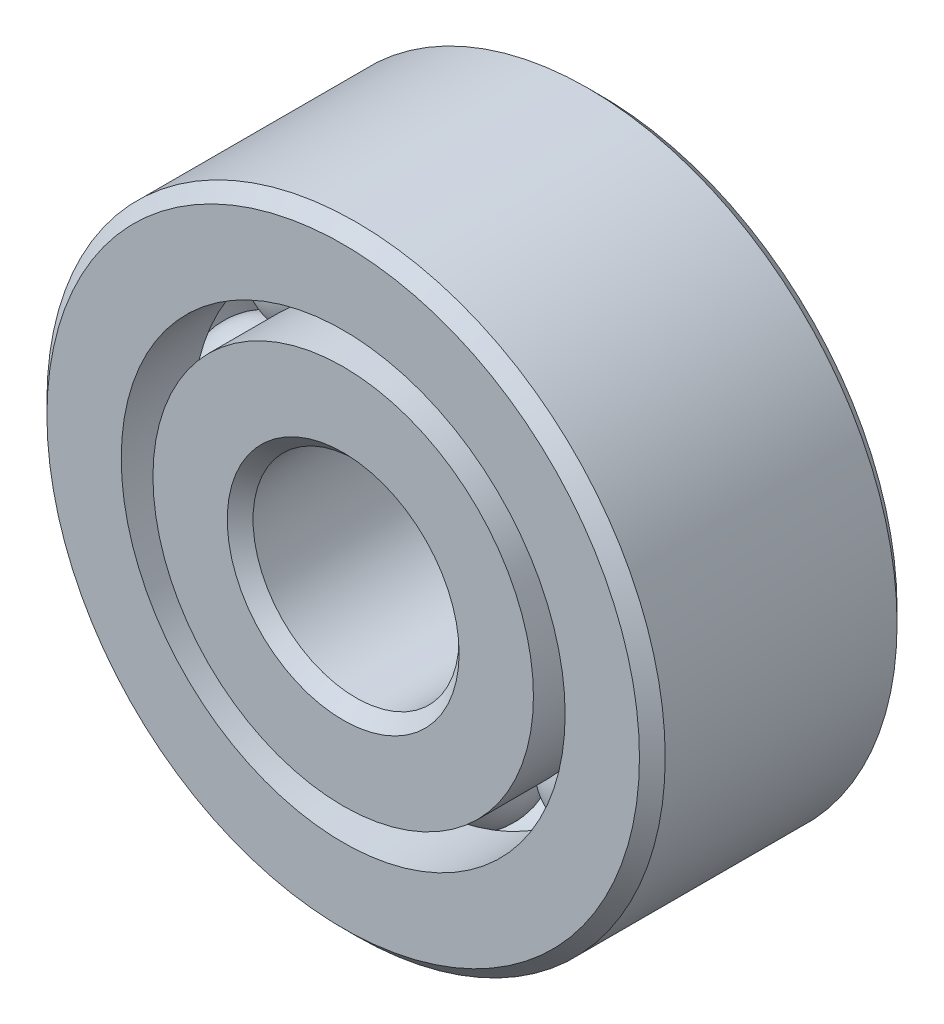
ISO-10303-21;
HEADER;
FILE_DESCRIPTION(('STEP AP214'),'2;1');
FILE_NAME('part.step','',(''),(''),'','','');
FILE_SCHEMA(('AUTOMOTIVE_DESIGN { 1 0 10303 214 1 1 1 1 }'));
ENDSEC;
DATA;
#1=APPLICATION_CONTEXT('core data for automotive mechanical design processes');
#2=APPLICATION_PROTOCOL_DEFINITION('international standard','automotive_design',2000,#1);
#3=PRODUCT_CONTEXT('',#1,'mechanical');
#4=PRODUCT('Part','Part','',(#3));
#5=PRODUCT_RELATED_PRODUCT_CATEGORY('part','',(#4));
#6=PRODUCT_DEFINITION_FORMATION('','',#4);
#7=PRODUCT_DEFINITION_CONTEXT('part definition',#1,'design');
#8=PRODUCT_DEFINITION('design','',#6,#7);
#9=PRODUCT_DEFINITION_SHAPE('','',#8);
#10=(LENGTH_UNIT() NAMED_UNIT(*) SI_UNIT(.MILLI.,.METRE.));
#11=(NAMED_UNIT(*) PLANE_ANGLE_UNIT() SI_UNIT($,.RADIAN.));
#12=(NAMED_UNIT(*) SI_UNIT($,.STERADIAN.) SOLID_ANGLE_UNIT());
#13=UNCERTAINTY_MEASURE_WITH_UNIT(LENGTH_MEASURE(1.E-05),#10,'distance_accuracy_value','');
#14=(GEOMETRIC_REPRESENTATION_CONTEXT(3) GLOBAL_UNCERTAINTY_ASSIGNED_CONTEXT((#13)) GLOBAL_UNIT_ASSIGNED_CONTEXT((#10,
#11,#12)) REPRESENTATION_CONTEXT('',''));
#15=CARTESIAN_POINT('',(0.,0.,0.));
#16=DIRECTION('',(0.,0.,1.));
#17=DIRECTION('',(1.,0.,0.));
#18=AXIS2_PLACEMENT_3D('',#15,#16,#17);
#19=CARTESIAN_POINT('',(-2.24506403026726,2.24506403026731,0.));
#20=DIRECTION('',(0.,0.,1.));
#21=DIRECTION('',(-0.707106781186539,0.707106781186556,0.));
#22=AXIS2_PLACEMENT_3D('',#19,#20,#21);
#23=SPHERICAL_SURFACE('',#22,0.915136422466877);
#24=CARTESIAN_POINT('',(-2.24506403026726,2.24506403026731,0.915136422466874));
#25=VERTEX_POINT('',#24);
#26=VERTEX_LOOP('',#25);
#27=FACE_BOUND('',#26,.T.);
#28=ADVANCED_FACE('F39',(#27),#23,.T.);
#29=CLOSED_SHELL('',(#28));
#30=MANIFOLD_SOLID_BREP('B2',#29);
#31=CARTESIAN_POINT('',(-3.175,0.,0.));
#32=DIRECTION('',(0.,0.,1.));
#33=DIRECTION('',(-1.,0.,0.));
#34=AXIS2_PLACEMENT_3D('',#31,#32,#33);
#35=SPHERICAL_SURFACE('',#34,0.915136422466877);
#36=CARTESIAN_POINT('',(-3.175,0.,0.915136422466874));
#37=VERTEX_POINT('',#36);
#38=VERTEX_LOOP('',#37);
#39=FACE_BOUND('',#38,.T.);
#40=ADVANCED_FACE('F59',(#39),#35,.T.);
#41=CLOSED_SHELL('',(#40));
#42=MANIFOLD_SOLID_BREP('B6',#41);
#43=CARTESIAN_POINT('',(-2.24506403026731,-2.24506403026727,0.));
#44=DIRECTION('',(0.,0.,1.));
#45=DIRECTION('',(-0.707106781186554,-0.707106781186541,0.));
#46=AXIS2_PLACEMENT_3D('',#43,#44,#45);
#47=SPHERICAL_SURFACE('',#46,0.915136422466877);
#48=CARTESIAN_POINT('',(-2.24506403026731,-2.24506403026727,0.915136422466874));
#49=VERTEX_POINT('',#48);
#50=VERTEX_LOOP('',#49);
#51=FACE_BOUND('',#50,.T.);
#52=ADVANCED_FACE('F79',(#51),#47,.T.);
#53=CLOSED_SHELL('',(#52));
#54=MANIFOLD_SOLID_BREP('B35',#53);
#55=CARTESIAN_POINT('',(0.,-3.175,0.));
#56=DIRECTION('',(0.,0.,1.));
#57=DIRECTION('',(0.,-1.,0.));
#58=AXIS2_PLACEMENT_3D('',#55,#56,#57);
#59=SPHERICAL_SURFACE('',#58,0.915136422466877);
#60=CARTESIAN_POINT('',(0.,-3.175,0.915136422466874));
#61=VERTEX_POINT('',#60);
#62=VERTEX_LOOP('',#61);
#63=FACE_BOUND('',#62,.T.);
#64=ADVANCED_FACE('F99',(#63),#59,.T.);
#65=CLOSED_SHELL('',(#64));
#66=MANIFOLD_SOLID_BREP('B55',#65);
#67=CARTESIAN_POINT('',(2.24506403026727,-2.2450640302673,0.));
#68=DIRECTION('',(0.,0.,1.));
#69=DIRECTION('',(0.707106781186544,-0.707106781186551,0.));
#70=AXIS2_PLACEMENT_3D('',#67,#68,#69);
#71=SPHERICAL_SURFACE('',#70,0.915136422466877);
#72=CARTESIAN_POINT('',(2.24506403026727,-2.2450640302673,0.915136422466874));
#73=VERTEX_POINT('',#72);
#74=VERTEX_LOOP('',#73);
#75=FACE_BOUND('',#74,.T.);
#76=ADVANCED_FACE('F119',(#75),#71,.T.);
#77=CLOSED_SHELL('',(#76));
#78=MANIFOLD_SOLID_BREP('B75',#77);
#79=CARTESIAN_POINT('',(3.175,0.,0.));
#80=DIRECTION('',(0.,0.,1.));
#81=DIRECTION('',(1.,0.,0.));
#82=AXIS2_PLACEMENT_3D('',#79,#80,#81);
#83=SPHERICAL_SURFACE('',#82,0.915136422466877);
#84=CARTESIAN_POINT('',(3.175,0.,0.915136422466874));
#85=VERTEX_POINT('',#84);
#86=VERTEX_LOOP('',#85);
#87=FACE_BOUND('',#86,.T.);
#88=ADVANCED_FACE('F139',(#87),#83,.T.);
#89=CLOSED_SHELL('',(#88));
#90=MANIFOLD_SOLID_BREP('B95',#89);
#91=CARTESIAN_POINT('',(2.24506403026729,2.24506403026728,0.));
#92=DIRECTION('',(0.,0.,1.));
#93=DIRECTION('',(0.707106781186549,0.707106781186546,0.));
#94=AXIS2_PLACEMENT_3D('',#91,#92,#93);
#95=SPHERICAL_SURFACE('',#94,0.915136422466877);
#96=CARTESIAN_POINT('',(2.24506403026729,2.24506403026728,0.915136422466874));
#97=VERTEX_POINT('',#96);
#98=VERTEX_LOOP('',#97);
#99=FACE_BOUND('',#98,.T.);
#100=ADVANCED_FACE('F159',(#99),#95,.T.);
#101=CLOSED_SHELL('',(#100));
#102=MANIFOLD_SOLID_BREP('B115',#101);
#103=CARTESIAN_POINT('',(0.,3.175,0.));
#104=DIRECTION('',(0.,0.,1.));
#105=DIRECTION('',(0.,1.,0.));
#106=AXIS2_PLACEMENT_3D('',#103,#104,#105);
#107=SPHERICAL_SURFACE('',#106,0.915136422466877);
#108=CARTESIAN_POINT('',(0.,3.175,0.915136422466874));
#109=VERTEX_POINT('',#108);
#110=VERTEX_LOOP('',#109);
#111=FACE_BOUND('',#110,.T.);
#112=ADVANCED_FACE('F181',(#111),#107,.T.);
#113=CLOSED_SHELL('',(#112));
#114=MANIFOLD_SOLID_BREP('B135',#113);
#115=CARTESIAN_POINT('',(0.,2.93076923076923,1.984375));
#116=DIRECTION('',(0.,0.,-1.));
#117=DIRECTION('',(-1.,0.,0.));
#118=AXIS2_PLACEMENT_3D('',#115,#116,#117);
#119=PLANE('',#118);
#120=CARTESIAN_POINT('',(0.,0.,1.984375));
#121=DIRECTION('',(0.,0.,1.));
#122=DIRECTION('',(1.,0.,0.));
#123=AXIS2_PLACEMENT_3D('',#120,#121,#122);
#124=CIRCLE('',#123,1.7859375);
#125=CARTESIAN_POINT('',(1.7859375,0.,1.984375));
#126=VERTEX_POINT('',#125);
#127=EDGE_CURVE('E228',#126,#126,#124,.T.);
#128=ORIENTED_EDGE('',*,*,#127,.F.);
#129=EDGE_LOOP('',(#128));
#130=FACE_BOUND('',#129,.T.);
#131=CARTESIAN_POINT('',(0.,0.,1.984375));
#132=DIRECTION('',(0.,0.,1.));
#133=DIRECTION('',(1.,0.,0.));
#134=AXIS2_PLACEMENT_3D('',#131,#132,#133);
#135=CIRCLE('',#134,2.93076923076923);
#136=CARTESIAN_POINT('',(2.93076923076923,0.,1.984375));
#137=VERTEX_POINT('',#136);
#138=EDGE_CURVE('E180',#137,#137,#135,.T.);
#139=ORIENTED_EDGE('',*,*,#138,.T.);
#140=EDGE_LOOP('',(#139));
#141=FACE_BOUND('',#140,.T.);
#142=ADVANCED_FACE('F200',(#130,#141),#119,.F.);
#143=CARTESIAN_POINT('',(0.,0.,1.984375));
#144=DIRECTION('',(0.,0.,1.));
#145=DIRECTION('',(1.,0.,0.));
#146=AXIS2_PLACEMENT_3D('',#143,#144,#145);
#147=CYLINDRICAL_SURFACE('',#146,2.93076923076923);
#148=ORIENTED_EDGE('',*,*,#138,.F.);
#149=EDGE_LOOP('',(#148));
#150=FACE_BOUND('',#149,.T.);
#151=CARTESIAN_POINT('',(0.,0.,0.881944444444442));
#152=DIRECTION('',(0.,0.,1.));
#153=DIRECTION('',(1.,0.,0.));
#154=AXIS2_PLACEMENT_3D('',#151,#152,#153);
#155=CIRCLE('',#154,2.93076923076923);
#156=CARTESIAN_POINT('',(2.93076923076923,0.,0.881944444444442));
#157=VERTEX_POINT('',#156);
#158=EDGE_CURVE('E206',#157,#157,#155,.T.);
#159=ORIENTED_EDGE('',*,*,#158,.T.);
#160=EDGE_LOOP('',(#159));
#161=FACE_BOUND('',#160,.T.);
#162=ADVANCED_FACE('F235',(#150,#161),#147,.T.);
#163=CARTESIAN_POINT('',(0.,0.,0.));
#164=DIRECTION('',(0.,0.,1.));
#165=DIRECTION('',(1.,0.,0.));
#166=AXIS2_PLACEMENT_3D('',#163,#164,#165);
#167=TOROIDAL_SURFACE('',#166,3.175,0.915136422466873);
#168=ORIENTED_EDGE('',*,*,#158,.F.);
#169=EDGE_LOOP('',(#168));
#170=FACE_BOUND('',#169,.T.);
#171=CARTESIAN_POINT('',(0.,0.,-0.881944444444445));
#172=DIRECTION('',(0.,0.,1.));
#173=DIRECTION('',(1.,0.,0.));
#174=AXIS2_PLACEMENT_3D('',#171,#172,#173);
#175=CIRCLE('',#174,2.93076923076923);
#176=CARTESIAN_POINT('',(2.93076923076923,0.,-0.881944444444445));
#177=VERTEX_POINT('',#176);
#178=EDGE_CURVE('E210',#177,#177,#175,.T.);
#179=ORIENTED_EDGE('',*,*,#178,.T.);
#180=EDGE_LOOP('',(#179));
#181=FACE_BOUND('',#180,.T.);
#182=ADVANCED_FACE('F239',(#170,#181),#167,.F.);
#183=CARTESIAN_POINT('',(0.,0.,1.984375));
#184=DIRECTION('',(0.,0.,1.));
#185=DIRECTION('',(1.,0.,0.));
#186=AXIS2_PLACEMENT_3D('',#183,#184,#185);
#187=CYLINDRICAL_SURFACE('',#186,2.93076923076923);
#188=ORIENTED_EDGE('',*,*,#178,.F.);
#189=EDGE_LOOP('',(#188));
#190=FACE_BOUND('',#189,.T.);
#191=CARTESIAN_POINT('',(0.,0.,-1.984375));
#192=DIRECTION('',(0.,0.,1.));
#193=DIRECTION('',(1.,0.,0.));
#194=AXIS2_PLACEMENT_3D('',#191,#192,#193);
#195=CIRCLE('',#194,2.93076923076923);
#196=CARTESIAN_POINT('',(2.93076923076923,0.,-1.984375));
#197=VERTEX_POINT('',#196);
#198=EDGE_CURVE('E214',#197,#197,#195,.T.);
#199=ORIENTED_EDGE('',*,*,#198,.T.);
#200=EDGE_LOOP('',(#199));
#201=FACE_BOUND('',#200,.T.);
#202=ADVANCED_FACE('F244',(#190,#201),#187,.T.);
#203=CARTESIAN_POINT('',(0.,1.7859375,-1.984375));
#204=DIRECTION('',(0.,0.,1.));
#205=DIRECTION('',(1.,0.,0.));
#206=AXIS2_PLACEMENT_3D('',#203,#204,#205);
#207=PLANE('',#206);
#208=ORIENTED_EDGE('',*,*,#198,.F.);
#209=EDGE_LOOP('',(#208));
#210=FACE_BOUND('',#209,.T.);
#211=CARTESIAN_POINT('',(0.,0.,-1.98437500000001));
#212=DIRECTION('',(0.,0.,1.));
#213=DIRECTION('',(1.,0.,0.));
#214=AXIS2_PLACEMENT_3D('',#211,#212,#213);
#215=CIRCLE('',#214,1.7859375);
#216=CARTESIAN_POINT('',(1.7859375,0.,-1.98437500000001));
#217=VERTEX_POINT('',#216);
#218=EDGE_CURVE('E219',#217,#217,#215,.T.);
#219=ORIENTED_EDGE('',*,*,#218,.T.);
#220=EDGE_LOOP('',(#219));
#221=FACE_BOUND('',#220,.T.);
#222=ADVANCED_FACE('F250',(#210,#221),#207,.F.);
#223=CARTESIAN_POINT('',(0.,0.,-1.78593750000001));
#224=DIRECTION('',(0.,0.,-1.));
#225=DIRECTION('',(-1.,0.,0.));
#226=AXIS2_PLACEMENT_3D('',#223,#224,#225);
#227=CONICAL_SURFACE('',#226,1.5875,0.785398163397446);
#228=ORIENTED_EDGE('',*,*,#218,.F.);
#229=EDGE_LOOP('',(#228));
#230=FACE_BOUND('',#229,.T.);
#231=CARTESIAN_POINT('',(0.,0.,-1.78593750000001));
#232=DIRECTION('',(0.,0.,1.));
#233=DIRECTION('',(1.,0.,0.));
#234=AXIS2_PLACEMENT_3D('',#231,#232,#233);
#235=CIRCLE('',#234,1.5875);
#236=CARTESIAN_POINT('',(1.5875,0.,-1.78593750000001));
#237=VERTEX_POINT('',#236);
#238=EDGE_CURVE('E222',#237,#237,#235,.T.);
#239=ORIENTED_EDGE('',*,*,#238,.T.);
#240=EDGE_LOOP('',(#239));
#241=FACE_BOUND('',#240,.T.);
#242=ADVANCED_FACE('F254',(#230,#241),#227,.F.);
#243=CARTESIAN_POINT('',(0.,0.,1.984375));
#244=DIRECTION('',(0.,0.,1.));
#245=DIRECTION('',(1.,0.,0.));
#246=AXIS2_PLACEMENT_3D('',#243,#244,#245);
#247=CYLINDRICAL_SURFACE('',#246,1.5875);
#248=ORIENTED_EDGE('',*,*,#238,.F.);
#249=EDGE_LOOP('',(#248));
#250=FACE_BOUND('',#249,.T.);
#251=CARTESIAN_POINT('',(0.,0.,1.7859375));
#252=DIRECTION('',(0.,0.,1.));
#253=DIRECTION('',(1.,0.,0.));
#254=AXIS2_PLACEMENT_3D('',#251,#252,#253);
#255=CIRCLE('',#254,1.5875);
#256=CARTESIAN_POINT('',(1.5875,0.,1.7859375));
#257=VERTEX_POINT('',#256);
#258=EDGE_CURVE('E225',#257,#257,#255,.T.);
#259=ORIENTED_EDGE('',*,*,#258,.T.);
#260=EDGE_LOOP('',(#259));
#261=FACE_BOUND('',#260,.T.);
#262=ADVANCED_FACE('F258',(#250,#261),#247,.F.);
#263=CARTESIAN_POINT('',(0.,0.,1.984375));
#264=DIRECTION('',(0.,0.,1.));
#265=DIRECTION('',(1.,0.,0.));
#266=AXIS2_PLACEMENT_3D('',#263,#264,#265);
#267=CONICAL_SURFACE('',#266,1.7859375,0.785398163397446);
#268=ORIENTED_EDGE('',*,*,#258,.F.);
#269=EDGE_LOOP('',(#268));
#270=FACE_BOUND('',#269,.T.);
#271=ORIENTED_EDGE('',*,*,#127,.T.);
#272=EDGE_LOOP('',(#271));
#273=FACE_BOUND('',#272,.T.);
#274=ADVANCED_FACE('F232',(#270,#273),#267,.F.);
#275=CLOSED_SHELL('',(#142,#162,#182,#202,#222,#242,#262,#274));
#276=MANIFOLD_SOLID_BREP('B155',#275);
#277=CARTESIAN_POINT('',(0.,0.,1.7859375));
#278=DIRECTION('',(0.,0.,-1.));
#279=DIRECTION('',(-1.,0.,0.));
#280=AXIS2_PLACEMENT_3D('',#277,#278,#279);
#281=CONICAL_SURFACE('',#280,4.7625,0.785398163397446);
#282=CARTESIAN_POINT('',(0.,0.,1.984375));
#283=DIRECTION('',(0.,0.,1.));
#284=DIRECTION('',(1.,0.,0.));
#285=AXIS2_PLACEMENT_3D('',#282,#283,#284);
#286=CIRCLE('',#285,4.5640625);
#287=CARTESIAN_POINT('',(4.5640625,0.,1.984375));
#288=VERTEX_POINT('',#287);
#289=EDGE_CURVE('E349',#288,#288,#286,.T.);
#290=ORIENTED_EDGE('',*,*,#289,.F.);
#291=EDGE_LOOP('',(#290));
#292=FACE_BOUND('',#291,.T.);
#293=CARTESIAN_POINT('',(0.,0.,1.7859375));
#294=DIRECTION('',(0.,0.,1.));
#295=DIRECTION('',(1.,0.,0.));
#296=AXIS2_PLACEMENT_3D('',#293,#294,#295);
#297=CIRCLE('',#296,4.7625);
#298=CARTESIAN_POINT('',(4.7625,0.,1.7859375));
#299=VERTEX_POINT('',#298);
#300=EDGE_CURVE('E199',#299,#299,#297,.T.);
#301=ORIENTED_EDGE('',*,*,#300,.T.);
#302=EDGE_LOOP('',(#301));
#303=FACE_BOUND('',#302,.T.);
#304=ADVANCED_FACE('F321',(#292,#303),#281,.T.);
#305=CARTESIAN_POINT('',(0.,0.,1.984375));
#306=DIRECTION('',(0.,0.,1.));
#307=DIRECTION('',(1.,0.,0.));
#308=AXIS2_PLACEMENT_3D('',#305,#306,#307);
#309=CYLINDRICAL_SURFACE('',#308,4.7625);
#310=ORIENTED_EDGE('',*,*,#300,.F.);
#311=EDGE_LOOP('',(#310));
#312=FACE_BOUND('',#311,.T.);
#313=CARTESIAN_POINT('',(0.,0.,-1.78593750000001));
#314=DIRECTION('',(0.,0.,1.));
#315=DIRECTION('',(1.,0.,0.));
#316=AXIS2_PLACEMENT_3D('',#313,#314,#315);
#317=CIRCLE('',#316,4.7625);
#318=CARTESIAN_POINT('',(4.7625,0.,-1.78593750000001));
#319=VERTEX_POINT('',#318);
#320=EDGE_CURVE('E327',#319,#319,#317,.T.);
#321=ORIENTED_EDGE('',*,*,#320,.T.);
#322=EDGE_LOOP('',(#321));
#323=FACE_BOUND('',#322,.T.);
#324=ADVANCED_FACE('F356',(#312,#323),#309,.T.);
#325=CARTESIAN_POINT('',(0.,0.,-1.98437500000001));
#326=DIRECTION('',(0.,0.,1.));
#327=DIRECTION('',(1.,0.,0.));
#328=AXIS2_PLACEMENT_3D('',#325,#326,#327);
#329=CONICAL_SURFACE('',#328,4.5640625,0.785398163397446);
#330=ORIENTED_EDGE('',*,*,#320,.F.);
#331=EDGE_LOOP('',(#330));
#332=FACE_BOUND('',#331,.T.);
#333=CARTESIAN_POINT('',(0.,0.,-1.98437500000001));
#334=DIRECTION('',(0.,0.,1.));
#335=DIRECTION('',(1.,0.,0.));
#336=AXIS2_PLACEMENT_3D('',#333,#334,#335);
#337=CIRCLE('',#336,4.5640625);
#338=CARTESIAN_POINT('',(4.5640625,0.,-1.98437500000001));
#339=VERTEX_POINT('',#338);
#340=EDGE_CURVE('E331',#339,#339,#337,.T.);
#341=ORIENTED_EDGE('',*,*,#340,.T.);
#342=EDGE_LOOP('',(#341));
#343=FACE_BOUND('',#342,.T.);
#344=ADVANCED_FACE('F360',(#332,#343),#329,.T.);
#345=CARTESIAN_POINT('',(0.,4.5640625,-1.98437500000001));
#346=DIRECTION('',(0.,0.,1.));
#347=DIRECTION('',(1.,0.,0.));
#348=AXIS2_PLACEMENT_3D('',#345,#346,#347);
#349=PLANE('',#348);
#350=ORIENTED_EDGE('',*,*,#340,.F.);
#351=EDGE_LOOP('',(#350));
#352=FACE_BOUND('',#351,.T.);
#353=CARTESIAN_POINT('',(0.,0.,-1.98437500000001));
#354=DIRECTION('',(0.,0.,1.));
#355=DIRECTION('',(1.,0.,0.));
#356=AXIS2_PLACEMENT_3D('',#353,#354,#355);
#357=CIRCLE('',#356,3.41923076923077);
#358=CARTESIAN_POINT('',(3.41923076923077,0.,-1.98437500000001));
#359=VERTEX_POINT('',#358);
#360=EDGE_CURVE('E335',#359,#359,#357,.T.);
#361=ORIENTED_EDGE('',*,*,#360,.T.);
#362=EDGE_LOOP('',(#361));
#363=FACE_BOUND('',#362,.T.);
#364=ADVANCED_FACE('F365',(#352,#363),#349,.F.);
#365=CARTESIAN_POINT('',(0.,0.,1.984375));
#366=DIRECTION('',(0.,0.,1.));
#367=DIRECTION('',(1.,0.,0.));
#368=AXIS2_PLACEMENT_3D('',#365,#366,#367);
#369=CYLINDRICAL_SURFACE('',#368,3.41923076923077);
#370=ORIENTED_EDGE('',*,*,#360,.F.);
#371=EDGE_LOOP('',(#370));
#372=FACE_BOUND('',#371,.T.);
#373=CARTESIAN_POINT('',(0.,0.,-0.881944444444447));
#374=DIRECTION('',(0.,0.,1.));
#375=DIRECTION('',(1.,0.,0.));
#376=AXIS2_PLACEMENT_3D('',#373,#374,#375);
#377=CIRCLE('',#376,3.41923076923077);
#378=CARTESIAN_POINT('',(3.41923076923077,0.,-0.881944444444447));
#379=VERTEX_POINT('',#378);
#380=EDGE_CURVE('E340',#379,#379,#377,.T.);
#381=ORIENTED_EDGE('',*,*,#380,.T.);
#382=EDGE_LOOP('',(#381));
#383=FACE_BOUND('',#382,.T.);
#384=ADVANCED_FACE('F371',(#372,#383),#369,.F.);
#385=CARTESIAN_POINT('',(0.,0.,0.));
#386=DIRECTION('',(0.,0.,1.));
#387=DIRECTION('',(1.,0.,0.));
#388=AXIS2_PLACEMENT_3D('',#385,#386,#387);
#389=TOROIDAL_SURFACE('',#388,3.175,0.915136422466877);
#390=ORIENTED_EDGE('',*,*,#380,.F.);
#391=EDGE_LOOP('',(#390));
#392=FACE_BOUND('',#391,.T.);
#393=CARTESIAN_POINT('',(0.,0.,0.881944444444442));
#394=DIRECTION('',(0.,0.,1.));
#395=DIRECTION('',(1.,0.,0.));
#396=AXIS2_PLACEMENT_3D('',#393,#394,#395);
#397=CIRCLE('',#396,3.41923076923077);
#398=CARTESIAN_POINT('',(3.41923076923077,0.,0.881944444444442));
#399=VERTEX_POINT('',#398);
#400=EDGE_CURVE('E343',#399,#399,#397,.T.);
#401=ORIENTED_EDGE('',*,*,#400,.T.);
#402=EDGE_LOOP('',(#401));
#403=FACE_BOUND('',#402,.T.);
#404=ADVANCED_FACE('F375',(#392,#403),#389,.F.);
#405=CARTESIAN_POINT('',(0.,0.,1.984375));
#406=DIRECTION('',(0.,0.,1.));
#407=DIRECTION('',(1.,0.,0.));
#408=AXIS2_PLACEMENT_3D('',#405,#406,#407);
#409=CYLINDRICAL_SURFACE('',#408,3.41923076923077);
#410=ORIENTED_EDGE('',*,*,#400,.F.);
#411=EDGE_LOOP('',(#410));
#412=FACE_BOUND('',#411,.T.);
#413=CARTESIAN_POINT('',(0.,0.,1.984375));
#414=DIRECTION('',(0.,0.,1.));
#415=DIRECTION('',(1.,0.,0.));
#416=AXIS2_PLACEMENT_3D('',#413,#414,#415);
#417=CIRCLE('',#416,3.41923076923077);
#418=CARTESIAN_POINT('',(3.41923076923077,0.,1.984375));
#419=VERTEX_POINT('',#418);
#420=EDGE_CURVE('E346',#419,#419,#417,.T.);
#421=ORIENTED_EDGE('',*,*,#420,.T.);
#422=EDGE_LOOP('',(#421));
#423=FACE_BOUND('',#422,.T.);
#424=ADVANCED_FACE('F379',(#412,#423),#409,.F.);
#425=CARTESIAN_POINT('',(0.,4.5640625,1.984375));
#426=DIRECTION('',(0.,0.,-1.));
#427=DIRECTION('',(-1.,0.,0.));
#428=AXIS2_PLACEMENT_3D('',#425,#426,#427);
#429=PLANE('',#428);
#430=ORIENTED_EDGE('',*,*,#420,.F.);
#431=EDGE_LOOP('',(#430));
#432=FACE_BOUND('',#431,.T.);
#433=ORIENTED_EDGE('',*,*,#289,.T.);
#434=EDGE_LOOP('',(#433));
#435=FACE_BOUND('',#434,.T.);
#436=ADVANCED_FACE('F353',(#432,#435),#429,.F.);
#437=CLOSED_SHELL('',(#304,#324,#344,#364,#384,#404,#424,#436));
#438=MANIFOLD_SOLID_BREP('B175',#437);
#439=ADVANCED_BREP_SHAPE_REPRESENTATION('',(#18,#30,#42,#54,#66,#78,#90,#102,#114,#276,#438),#14);
#440=SHAPE_DEFINITION_REPRESENTATION(#9,#439);
ENDSEC;
END-ISO-10303-21;
